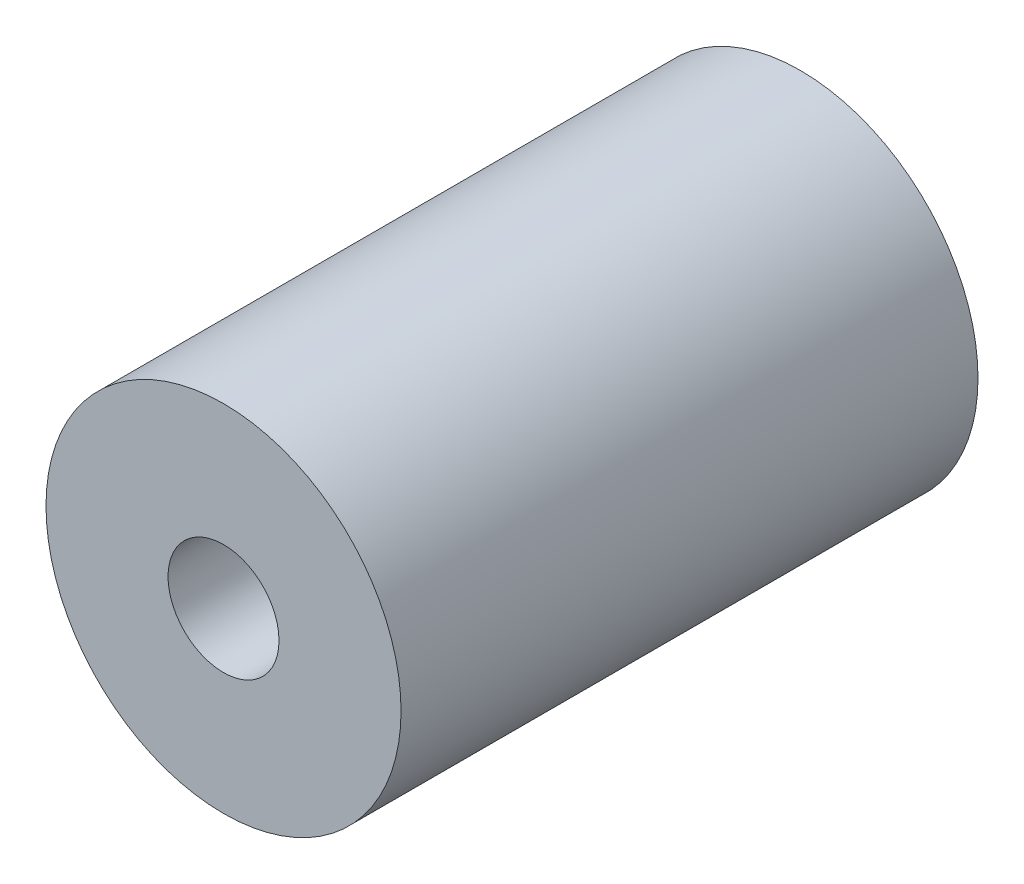
ISO-10303-21;
HEADER;
FILE_DESCRIPTION(('STEP AP214'),'2;1');
FILE_NAME('part.step','',(''),(''),'','','');
FILE_SCHEMA(('AUTOMOTIVE_DESIGN { 1 0 10303 214 1 1 1 1 }'));
ENDSEC;
DATA;
#1=APPLICATION_CONTEXT('core data for automotive mechanical design processes');
#2=APPLICATION_PROTOCOL_DEFINITION('international standard','automotive_design',2000,#1);
#3=PRODUCT_CONTEXT('',#1,'mechanical');
#4=PRODUCT('Part','Part','',(#3));
#5=PRODUCT_RELATED_PRODUCT_CATEGORY('part','',(#4));
#6=PRODUCT_DEFINITION_FORMATION('','',#4);
#7=PRODUCT_DEFINITION_CONTEXT('part definition',#1,'design');
#8=PRODUCT_DEFINITION('design','',#6,#7);
#9=PRODUCT_DEFINITION_SHAPE('','',#8);
#10=(LENGTH_UNIT() NAMED_UNIT(*) SI_UNIT(.MILLI.,.METRE.));
#11=(NAMED_UNIT(*) PLANE_ANGLE_UNIT() SI_UNIT($,.RADIAN.));
#12=(NAMED_UNIT(*) SI_UNIT($,.STERADIAN.) SOLID_ANGLE_UNIT());
#13=UNCERTAINTY_MEASURE_WITH_UNIT(LENGTH_MEASURE(1.E-05),#10,'distance_accuracy_value','');
#14=(GEOMETRIC_REPRESENTATION_CONTEXT(3) GLOBAL_UNCERTAINTY_ASSIGNED_CONTEXT((#13)) GLOBAL_UNIT_ASSIGNED_CONTEXT((#10,
#11,#12)) REPRESENTATION_CONTEXT('',''));
#15=CARTESIAN_POINT('',(0.,0.,0.));
#16=DIRECTION('',(0.,0.,1.));
#17=DIRECTION('',(1.,0.,0.));
#18=AXIS2_PLACEMENT_3D('',#15,#16,#17);
#19=CARTESIAN_POINT('',(0.,0.,26.));
#20=DIRECTION('',(0.,0.,-1.));
#21=DIRECTION('',(-1.,0.,0.));
#22=AXIS2_PLACEMENT_3D('',#19,#20,#21);
#23=CYLINDRICAL_SURFACE('',#22,2.5);
#24=CARTESIAN_POINT('',(0.,0.,0.));
#25=DIRECTION('',(0.,0.,1.));
#26=DIRECTION('',(1.,0.,0.));
#27=AXIS2_PLACEMENT_3D('',#24,#25,#26);
#28=CIRCLE('',#27,2.5);
#29=CARTESIAN_POINT('',(2.5,0.,0.));
#30=VERTEX_POINT('',#29);
#31=EDGE_CURVE('E49',#30,#30,#28,.T.);
#32=ORIENTED_EDGE('',*,*,#31,.F.);
#33=EDGE_LOOP('',(#32));
#34=FACE_BOUND('',#33,.T.);
#35=CARTESIAN_POINT('',(0.,0.,8.));
#36=DIRECTION('',(0.,0.,1.));
#37=DIRECTION('',(1.,0.,0.));
#38=AXIS2_PLACEMENT_3D('',#35,#36,#37);
#39=CIRCLE('',#38,2.5);
#40=CARTESIAN_POINT('',(2.5,0.,8.));
#41=VERTEX_POINT('',#40);
#42=EDGE_CURVE('E37',#41,#41,#39,.T.);
#43=ORIENTED_EDGE('',*,*,#42,.T.);
#44=EDGE_LOOP('',(#43));
#45=FACE_BOUND('',#44,.T.);
#46=ADVANCED_FACE('F33',(#34,#45),#23,.F.);
#47=CARTESIAN_POINT('',(0.,0.,26.));
#48=DIRECTION('',(0.,0.,1.));
#49=DIRECTION('',(1.,0.,0.));
#50=AXIS2_PLACEMENT_3D('',#47,#48,#49);
#51=PLANE('',#50);
#52=CARTESIAN_POINT('',(0.,0.,26.));
#53=DIRECTION('',(0.,0.,1.));
#54=DIRECTION('',(1.,0.,0.));
#55=AXIS2_PLACEMENT_3D('',#52,#53,#54);
#56=CIRCLE('',#55,8.);
#57=CARTESIAN_POINT('',(8.,0.,26.));
#58=VERTEX_POINT('',#57);
#59=EDGE_CURVE('E10',#58,#58,#56,.T.);
#60=ORIENTED_EDGE('',*,*,#59,.T.);
#61=EDGE_LOOP('',(#60));
#62=FACE_BOUND('',#61,.T.);
#63=CARTESIAN_POINT('',(0.,0.,26.));
#64=DIRECTION('',(0.,0.,1.));
#65=DIRECTION('',(1.,0.,0.));
#66=AXIS2_PLACEMENT_3D('',#63,#64,#65);
#67=CIRCLE('',#66,2.5);
#68=CARTESIAN_POINT('',(2.5,0.,26.));
#69=VERTEX_POINT('',#68);
#70=EDGE_CURVE('E46',#69,#69,#67,.T.);
#71=ORIENTED_EDGE('',*,*,#70,.F.);
#72=EDGE_LOOP('',(#71));
#73=FACE_BOUND('',#72,.T.);
#74=ADVANCED_FACE('F74',(#62,#73),#51,.T.);
#75=CARTESIAN_POINT('',(0.,0.,0.));
#76=DIRECTION('',(0.,0.,1.));
#77=DIRECTION('',(1.,0.,0.));
#78=AXIS2_PLACEMENT_3D('',#75,#76,#77);
#79=PLANE('',#78);
#80=CARTESIAN_POINT('',(0.,0.,0.));
#81=DIRECTION('',(0.,0.,1.));
#82=DIRECTION('',(1.,0.,0.));
#83=AXIS2_PLACEMENT_3D('',#80,#81,#82);
#84=CIRCLE('',#83,8.);
#85=CARTESIAN_POINT('',(8.,0.,0.));
#86=VERTEX_POINT('',#85);
#87=EDGE_CURVE('E41',#86,#86,#84,.T.);
#88=ORIENTED_EDGE('',*,*,#87,.F.);
#89=EDGE_LOOP('',(#88));
#90=FACE_BOUND('',#89,.T.);
#91=ORIENTED_EDGE('',*,*,#31,.T.);
#92=EDGE_LOOP('',(#91));
#93=FACE_BOUND('',#92,.T.);
#94=ADVANCED_FACE('F70',(#90,#93),#79,.F.);
#95=CARTESIAN_POINT('',(0.,0.,26.));
#96=DIRECTION('',(0.,0.,-1.));
#97=DIRECTION('',(-1.,0.,0.));
#98=AXIS2_PLACEMENT_3D('',#95,#96,#97);
#99=CYLINDRICAL_SURFACE('',#98,8.);
#100=ORIENTED_EDGE('',*,*,#59,.F.);
#101=EDGE_LOOP('',(#100));
#102=FACE_BOUND('',#101,.T.);
#103=ORIENTED_EDGE('',*,*,#87,.T.);
#104=EDGE_LOOP('',(#103));
#105=FACE_BOUND('',#104,.T.);
#106=ADVANCED_FACE('F35',(#102,#105),#99,.T.);
#107=CARTESIAN_POINT('',(0.,0.,18.));
#108=DIRECTION('',(0.,0.,1.));
#109=DIRECTION('',(1.,0.,0.));
#110=AXIS2_PLACEMENT_3D('',#107,#108,#109);
#111=CIRCLE('',#110,2.5);
#112=CARTESIAN_POINT('',(2.5,0.,18.));
#113=VERTEX_POINT('',#112);
#114=EDGE_CURVE('E51',#113,#113,#111,.T.);
#115=ORIENTED_EDGE('',*,*,#114,.F.);
#116=EDGE_LOOP('',(#115));
#117=FACE_BOUND('',#116,.T.);
#118=ORIENTED_EDGE('',*,*,#70,.T.);
#119=EDGE_LOOP('',(#118));
#120=FACE_BOUND('',#119,.T.);
#121=ADVANCED_FACE('F76',(#117,#120),#23,.F.);
#122=CARTESIAN_POINT('',(0.,0.,8.));
#123=DIRECTION('',(0.,0.,1.));
#124=DIRECTION('',(1.,0.,0.));
#125=AXIS2_PLACEMENT_3D('',#122,#123,#124);
#126=CYLINDRICAL_SURFACE('',#125,3.5);
#127=CARTESIAN_POINT('',(0.,0.,8.));
#128=DIRECTION('',(0.,0.,1.));
#129=DIRECTION('',(1.,0.,0.));
#130=AXIS2_PLACEMENT_3D('',#127,#128,#129);
#131=CIRCLE('',#130,3.5);
#132=CARTESIAN_POINT('',(3.5,0.,8.));
#133=VERTEX_POINT('',#132);
#134=EDGE_CURVE('E53',#133,#133,#131,.T.);
#135=ORIENTED_EDGE('',*,*,#134,.F.);
#136=EDGE_LOOP('',(#135));
#137=FACE_BOUND('',#136,.T.);
#138=CARTESIAN_POINT('',(0.,0.,18.));
#139=DIRECTION('',(0.,0.,1.));
#140=DIRECTION('',(1.,0.,0.));
#141=AXIS2_PLACEMENT_3D('',#138,#139,#140);
#142=CIRCLE('',#141,3.5);
#143=CARTESIAN_POINT('',(3.5,0.,18.));
#144=VERTEX_POINT('',#143);
#145=EDGE_CURVE('E58',#144,#144,#142,.T.);
#146=ORIENTED_EDGE('',*,*,#145,.T.);
#147=EDGE_LOOP('',(#146));
#148=FACE_BOUND('',#147,.T.);
#149=ADVANCED_FACE('F82',(#137,#148),#126,.F.);
#150=CARTESIAN_POINT('',(0.,0.,8.));
#151=DIRECTION('',(0.,0.,1.));
#152=DIRECTION('',(1.,0.,0.));
#153=AXIS2_PLACEMENT_3D('',#150,#151,#152);
#154=PLANE('',#153);
#155=ORIENTED_EDGE('',*,*,#42,.F.);
#156=EDGE_LOOP('',(#155));
#157=FACE_BOUND('',#156,.T.);
#158=ORIENTED_EDGE('',*,*,#134,.T.);
#159=EDGE_LOOP('',(#158));
#160=FACE_BOUND('',#159,.T.);
#161=ADVANCED_FACE('F79',(#157,#160),#154,.T.);
#162=CARTESIAN_POINT('',(0.,0.,18.));
#163=DIRECTION('',(0.,0.,1.));
#164=DIRECTION('',(1.,0.,0.));
#165=AXIS2_PLACEMENT_3D('',#162,#163,#164);
#166=PLANE('',#165);
#167=ORIENTED_EDGE('',*,*,#114,.T.);
#168=EDGE_LOOP('',(#167));
#169=FACE_BOUND('',#168,.T.);
#170=ORIENTED_EDGE('',*,*,#145,.F.);
#171=EDGE_LOOP('',(#170));
#172=FACE_BOUND('',#171,.T.);
#173=ADVANCED_FACE('F81',(#169,#172),#166,.F.);
#174=CLOSED_SHELL('',(#46,#74,#94,#106,#121,#149,#161,#173));
#175=MANIFOLD_SOLID_BREP('B2',#174);
#176=ADVANCED_BREP_SHAPE_REPRESENTATION('',(#18,#175),#14);
#177=SHAPE_DEFINITION_REPRESENTATION(#9,#176);
ENDSEC;
END-ISO-10303-21;
